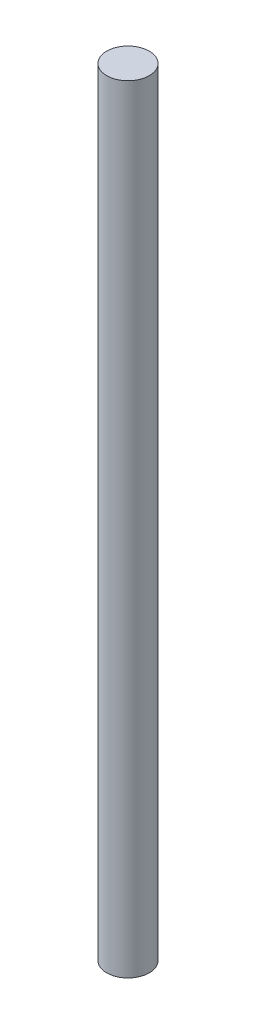
ISO-10303-21;
HEADER;
FILE_DESCRIPTION(('STEP AP214'),'2;1');
FILE_NAME('part.step','',(''),(''),'','','');
FILE_SCHEMA(('AUTOMOTIVE_DESIGN { 1 0 10303 214 1 1 1 1 }'));
ENDSEC;
DATA;
#1=APPLICATION_CONTEXT('core data for automotive mechanical design processes');
#2=APPLICATION_PROTOCOL_DEFINITION('international standard','automotive_design',2000,#1);
#3=PRODUCT_CONTEXT('',#1,'mechanical');
#4=PRODUCT('Part','Part','',(#3));
#5=PRODUCT_RELATED_PRODUCT_CATEGORY('part','',(#4));
#6=PRODUCT_DEFINITION_FORMATION('','',#4);
#7=PRODUCT_DEFINITION_CONTEXT('part definition',#1,'design');
#8=PRODUCT_DEFINITION('design','',#6,#7);
#9=PRODUCT_DEFINITION_SHAPE('','',#8);
#10=(LENGTH_UNIT() NAMED_UNIT(*) SI_UNIT(.MILLI.,.METRE.));
#11=(NAMED_UNIT(*) PLANE_ANGLE_UNIT() SI_UNIT($,.RADIAN.));
#12=(NAMED_UNIT(*) SI_UNIT($,.STERADIAN.) SOLID_ANGLE_UNIT());
#13=UNCERTAINTY_MEASURE_WITH_UNIT(LENGTH_MEASURE(1.E-05),#10,'distance_accuracy_value','');
#14=(GEOMETRIC_REPRESENTATION_CONTEXT(3) GLOBAL_UNCERTAINTY_ASSIGNED_CONTEXT((#13)) GLOBAL_UNIT_ASSIGNED_CONTEXT((#10,
#11,#12)) REPRESENTATION_CONTEXT('',''));
#15=CARTESIAN_POINT('',(0.,0.,0.));
#16=DIRECTION('',(0.,0.,1.));
#17=DIRECTION('',(1.,0.,0.));
#18=AXIS2_PLACEMENT_3D('',#15,#16,#17);
#19=CARTESIAN_POINT('',(0.,73.,0.));
#20=DIRECTION('',(0.,-1.,0.));
#21=DIRECTION('',(0.,0.,-1.));
#22=AXIS2_PLACEMENT_3D('',#19,#20,#21);
#23=CYLINDRICAL_SURFACE('',#22,2.);
#24=CARTESIAN_POINT('',(0.,73.,0.));
#25=DIRECTION('',(0.,1.,0.));
#26=DIRECTION('',(0.,0.,1.));
#27=AXIS2_PLACEMENT_3D('',#24,#25,#26);
#28=CIRCLE('',#27,2.);
#29=CARTESIAN_POINT('',(0.,73.,2.));
#30=VERTEX_POINT('',#29);
#31=EDGE_CURVE('E10',#30,#30,#28,.T.);
#32=ORIENTED_EDGE('',*,*,#31,.F.);
#33=EDGE_LOOP('',(#32));
#34=FACE_BOUND('',#33,.T.);
#35=CARTESIAN_POINT('',(0.,0.,0.));
#36=DIRECTION('',(0.,1.,0.));
#37=DIRECTION('',(0.,0.,1.));
#38=AXIS2_PLACEMENT_3D('',#35,#36,#37);
#39=CIRCLE('',#38,2.);
#40=CARTESIAN_POINT('',(0.,0.,2.));
#41=VERTEX_POINT('',#40);
#42=EDGE_CURVE('E40',#41,#41,#39,.T.);
#43=ORIENTED_EDGE('',*,*,#42,.T.);
#44=EDGE_LOOP('',(#43));
#45=FACE_BOUND('',#44,.T.);
#46=ADVANCED_FACE('F37',(#34,#45),#23,.T.);
#47=CARTESIAN_POINT('',(0.,73.,0.));
#48=DIRECTION('',(0.,1.,0.));
#49=DIRECTION('',(0.,0.,1.));
#50=AXIS2_PLACEMENT_3D('',#47,#48,#49);
#51=PLANE('',#50);
#52=ORIENTED_EDGE('',*,*,#31,.T.);
#53=EDGE_LOOP('',(#52));
#54=FACE_BOUND('',#53,.T.);
#55=ADVANCED_FACE('F54',(#54),#51,.T.);
#56=CARTESIAN_POINT('',(0.,0.,0.));
#57=DIRECTION('',(0.,1.,0.));
#58=DIRECTION('',(0.,0.,1.));
#59=AXIS2_PLACEMENT_3D('',#56,#57,#58);
#60=PLANE('',#59);
#61=ORIENTED_EDGE('',*,*,#42,.F.);
#62=EDGE_LOOP('',(#61));
#63=FACE_BOUND('',#62,.T.);
#64=ADVANCED_FACE('F52',(#63),#60,.F.);
#65=CLOSED_SHELL('',(#46,#55,#64));
#66=MANIFOLD_SOLID_BREP('B2',#65);
#67=ADVANCED_BREP_SHAPE_REPRESENTATION('',(#18,#66),#14);
#68=SHAPE_DEFINITION_REPRESENTATION(#9,#67);
ENDSEC;
END-ISO-10303-21;
